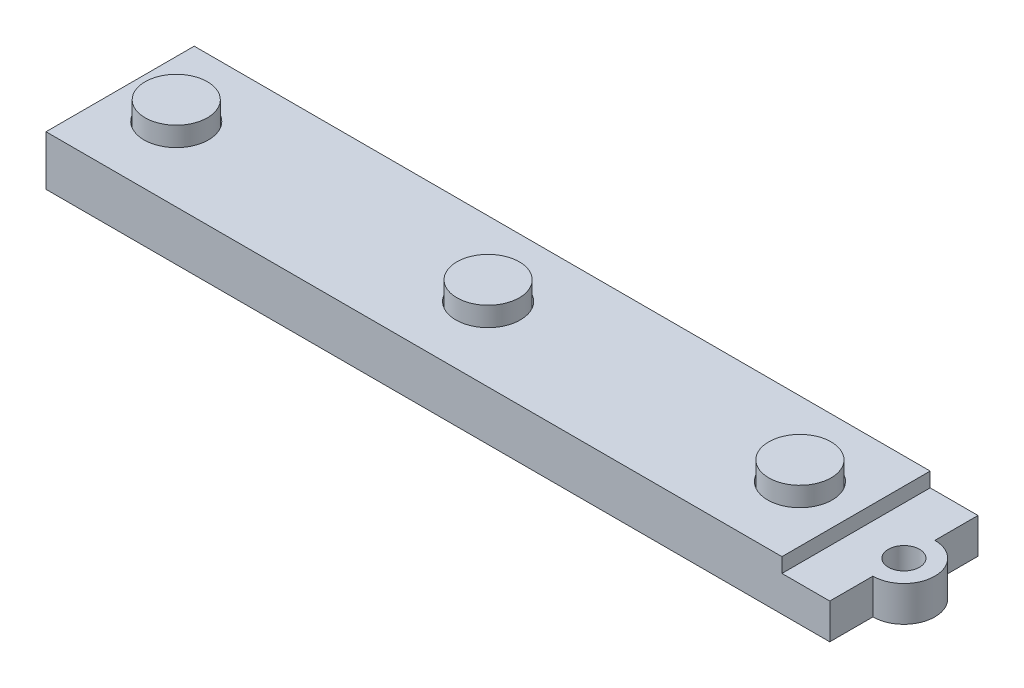
ISO-10303-21;
HEADER;
FILE_DESCRIPTION(('STEP AP214'),'2;1');
FILE_NAME('part.step','',(''),(''),'','','');
FILE_SCHEMA(('AUTOMOTIVE_DESIGN { 1 0 10303 214 1 1 1 1 }'));
ENDSEC;
DATA;
#1=APPLICATION_CONTEXT('core data for automotive mechanical design processes');
#2=APPLICATION_PROTOCOL_DEFINITION('international standard','automotive_design',2000,#1);
#3=PRODUCT_CONTEXT('',#1,'mechanical');
#4=PRODUCT('Part','Part','',(#3));
#5=PRODUCT_RELATED_PRODUCT_CATEGORY('part','',(#4));
#6=PRODUCT_DEFINITION_FORMATION('','',#4);
#7=PRODUCT_DEFINITION_CONTEXT('part definition',#1,'design');
#8=PRODUCT_DEFINITION('design','',#6,#7);
#9=PRODUCT_DEFINITION_SHAPE('','',#8);
#10=(LENGTH_UNIT() NAMED_UNIT(*) SI_UNIT(.MILLI.,.METRE.));
#11=(NAMED_UNIT(*) PLANE_ANGLE_UNIT() SI_UNIT($,.RADIAN.));
#12=(NAMED_UNIT(*) SI_UNIT($,.STERADIAN.) SOLID_ANGLE_UNIT());
#13=UNCERTAINTY_MEASURE_WITH_UNIT(LENGTH_MEASURE(1.E-05),#10,'distance_accuracy_value','');
#14=(GEOMETRIC_REPRESENTATION_CONTEXT(3) GLOBAL_UNCERTAINTY_ASSIGNED_CONTEXT((#13)) GLOBAL_UNIT_ASSIGNED_CONTEXT((#10,
#11,#12)) REPRESENTATION_CONTEXT('',''));
#15=CARTESIAN_POINT('',(0.,0.,0.));
#16=DIRECTION('',(0.,0.,1.));
#17=DIRECTION('',(1.,0.,0.));
#18=AXIS2_PLACEMENT_3D('',#15,#16,#17);
#19=CARTESIAN_POINT('',(0.,0.,0.));
#20=DIRECTION('',(0.,1.,0.));
#21=DIRECTION('',(0.,0.,1.));
#22=AXIS2_PLACEMENT_3D('',#19,#20,#21);
#23=PLANE('',#22);
#24=CARTESIAN_POINT('',(-20.4046666666667,0.,-25.8942737373737));
#25=DIRECTION('',(0.,1.,0.));
#26=DIRECTION('',(0.,0.,1.));
#27=AXIS2_PLACEMENT_3D('',#24,#25,#26);
#28=CIRCLE('',#27,1.905);
#29=CARTESIAN_POINT('',(-20.4046666666667,0.,-23.9892737373737));
#30=VERTEX_POINT('',#29);
#31=EDGE_CURVE('E209',#30,#30,#28,.T.);
#32=ORIENTED_EDGE('',*,*,#31,.T.);
#33=EDGE_LOOP('',(#32));
#34=FACE_BOUND('',#33,.T.);
#35=DIRECTION('',(0.,0.,-1.));
#36=VECTOR('',#35,1.);
#37=CARTESIAN_POINT('',(-112.479666666667,0.,-32.2442737373737));
#38=LINE('',#37,#36);
#39=CARTESIAN_POINT('',(-112.479666666667,0.,-19.5442737373737));
#40=VERTEX_POINT('',#39);
#41=CARTESIAN_POINT('',(-112.479666666667,0.,-32.2442737373737));
#42=VERTEX_POINT('',#41);
#43=EDGE_CURVE('E160',#40,#42,#38,.T.);
#44=ORIENTED_EDGE('',*,*,#43,.F.);
#45=DIRECTION('',(-1.,0.,0.));
#46=VECTOR('',#45,1.);
#47=CARTESIAN_POINT('',(-29.9296666666666,0.,-19.5442737373737));
#48=LINE('',#47,#46);
#49=CARTESIAN_POINT('',(-29.9296666666666,0.,-19.5442737373737));
#50=VERTEX_POINT('',#49);
#51=EDGE_CURVE('E165',#50,#40,#48,.T.);
#52=ORIENTED_EDGE('',*,*,#51,.F.);
#53=DIRECTION('',(0.,0.,1.));
#54=VECTOR('',#53,1.);
#55=CARTESIAN_POINT('',(-29.9296666666666,0.,-32.2442737373737));
#56=LINE('',#55,#54);
#57=CARTESIAN_POINT('',(-29.9296666666666,0.,-32.2442737373737));
#58=VERTEX_POINT('',#57);
#59=EDGE_CURVE('E175',#58,#50,#56,.T.);
#60=ORIENTED_EDGE('',*,*,#59,.F.);
#61=DIRECTION('',(1.,0.,0.));
#62=VECTOR('',#61,1.);
#63=CARTESIAN_POINT('',(-29.9296666666666,0.,-32.2442737373737));
#64=LINE('',#63,#62);
#65=EDGE_CURVE('E58',#42,#58,#64,.T.);
#66=ORIENTED_EDGE('',*,*,#65,.F.);
#67=EDGE_LOOP('',(#44,#52,#60,#66));
#68=FACE_BOUND('',#67,.T.);
#69=DIRECTION('',(-1.,0.,0.));
#70=VECTOR('',#69,1.);
#71=CARTESIAN_POINT('',(-116.162666666667,0.,-34.9493737373737));
#72=LINE('',#71,#70);
#73=CARTESIAN_POINT('',(-20.4046666666667,0.,-34.9493737373737));
#74=VERTEX_POINT('',#73);
#75=CARTESIAN_POINT('',(-116.162666666667,0.,-34.9493737373737));
#76=VERTEX_POINT('',#75);
#77=EDGE_CURVE('E231',#74,#76,#72,.T.);
#78=ORIENTED_EDGE('',*,*,#77,.F.);
#79=DIRECTION('',(0.,0.,1.));
#80=VECTOR('',#79,1.);
#81=CARTESIAN_POINT('',(-20.4046666666667,0.,0.));
#82=LINE('',#81,#80);
#83=CARTESIAN_POINT('',(-20.4046666666667,0.,-29.6800450522713));
#84=VERTEX_POINT('',#83);
#85=EDGE_CURVE('E157',#74,#84,#82,.T.);
#86=ORIENTED_EDGE('',*,*,#85,.T.);
#87=CARTESIAN_POINT('',(-20.4046666666667,0.,-25.8942737373737));
#88=DIRECTION('',(0.,1.,0.));
#89=DIRECTION('',(0.,0.,1.));
#90=AXIS2_PLACEMENT_3D('',#87,#88,#89);
#91=CIRCLE('',#90,3.78577131489756);
#92=CARTESIAN_POINT('',(-20.4046666666667,0.,-22.1085024224762));
#93=VERTEX_POINT('',#92);
#94=EDGE_CURVE('E153',#84,#93,#91,.F.);
#95=ORIENTED_EDGE('',*,*,#94,.T.);
#96=DIRECTION('',(0.,0.,1.));
#97=VECTOR('',#96,1.);
#98=CARTESIAN_POINT('',(-20.4046666666666,0.,0.));
#99=LINE('',#98,#97);
#100=CARTESIAN_POINT('',(-20.4046666666666,0.,-16.8391737373737));
#101=VERTEX_POINT('',#100);
#102=EDGE_CURVE('E131',#93,#101,#99,.T.);
#103=ORIENTED_EDGE('',*,*,#102,.T.);
#104=DIRECTION('',(1.,0.,0.));
#105=VECTOR('',#104,1.);
#106=CARTESIAN_POINT('',(-116.162666666667,0.,-16.8391737373737));
#107=LINE('',#106,#105);
#108=CARTESIAN_POINT('',(-116.162666666667,0.,-16.8391737373737));
#109=VERTEX_POINT('',#108);
#110=EDGE_CURVE('E238',#109,#101,#107,.T.);
#111=ORIENTED_EDGE('',*,*,#110,.F.);
#112=DIRECTION('',(0.,0.,1.));
#113=VECTOR('',#112,1.);
#114=CARTESIAN_POINT('',(-116.162666666667,0.,-34.9493737373737));
#115=LINE('',#114,#113);
#116=EDGE_CURVE('E224',#76,#109,#115,.T.);
#117=ORIENTED_EDGE('',*,*,#116,.F.);
#118=EDGE_LOOP('',(#78,#86,#95,#103,#111,#117));
#119=FACE_BOUND('',#118,.T.);
#120=ADVANCED_FACE('F35',(#34,#68,#119),#23,.F.);
#121=CARTESIAN_POINT('',(0.,4.318,0.));
#122=DIRECTION('',(0.,1.,0.));
#123=DIRECTION('',(0.,0.,1.));
#124=AXIS2_PLACEMENT_3D('',#121,#122,#123);
#125=PLANE('',#124);
#126=CARTESIAN_POINT('',(-20.4046666666667,4.318,-25.8942737373737));
#127=DIRECTION('',(0.,1.,0.));
#128=DIRECTION('',(0.,0.,1.));
#129=AXIS2_PLACEMENT_3D('',#126,#127,#128);
#130=CIRCLE('',#129,1.905);
#131=CARTESIAN_POINT('',(-20.4046666666667,4.318,-23.9892737373737));
#132=VERTEX_POINT('',#131);
#133=EDGE_CURVE('E206',#132,#132,#130,.T.);
#134=ORIENTED_EDGE('',*,*,#133,.F.);
#135=EDGE_LOOP('',(#134));
#136=FACE_BOUND('',#135,.T.);
#137=DIRECTION('',(0.,0.,1.));
#138=VECTOR('',#137,1.);
#139=CARTESIAN_POINT('',(-20.4046666666667,4.318,-34.9493737373737));
#140=LINE('',#139,#138);
#141=CARTESIAN_POINT('',(-20.4046666666667,4.318,-34.9493737373737));
#142=VERTEX_POINT('',#141);
#143=CARTESIAN_POINT('',(-20.4046666666667,4.318,-29.6800450522713));
#144=VERTEX_POINT('',#143);
#145=EDGE_CURVE('E50',#142,#144,#140,.T.);
#146=ORIENTED_EDGE('',*,*,#145,.F.);
#147=DIRECTION('',(-1.,0.,0.));
#148=VECTOR('',#147,1.);
#149=CARTESIAN_POINT('',(-26.2466666666667,4.318,-34.9493737373737));
#150=LINE('',#149,#148);
#151=CARTESIAN_POINT('',(-26.2466666666667,4.318,-34.9493737373737));
#152=VERTEX_POINT('',#151);
#153=EDGE_CURVE('E218',#142,#152,#150,.T.);
#154=ORIENTED_EDGE('',*,*,#153,.T.);
#155=DIRECTION('',(0.,0.,1.));
#156=VECTOR('',#155,1.);
#157=CARTESIAN_POINT('',(-26.2466666666667,4.318,-34.9493737373737));
#158=LINE('',#157,#156);
#159=CARTESIAN_POINT('',(-26.2466666666667,4.318,-16.8391737373737));
#160=VERTEX_POINT('',#159);
#161=EDGE_CURVE('E215',#152,#160,#158,.T.);
#162=ORIENTED_EDGE('',*,*,#161,.T.);
#163=DIRECTION('',(1.,0.,0.));
#164=VECTOR('',#163,1.);
#165=CARTESIAN_POINT('',(-26.2466666666667,4.318,-16.8391737373737));
#166=LINE('',#165,#164);
#167=CARTESIAN_POINT('',(-20.4046666666666,4.318,-16.8391737373737));
#168=VERTEX_POINT('',#167);
#169=EDGE_CURVE('E146',#160,#168,#166,.T.);
#170=ORIENTED_EDGE('',*,*,#169,.T.);
#171=DIRECTION('',(0.,0.,1.));
#172=VECTOR('',#171,1.);
#173=CARTESIAN_POINT('',(-20.4046666666667,4.318,-22.1085024224762));
#174=LINE('',#173,#172);
#175=CARTESIAN_POINT('',(-20.4046666666667,4.318,-22.1085024224762));
#176=VERTEX_POINT('',#175);
#177=EDGE_CURVE('E128',#176,#168,#174,.T.);
#178=ORIENTED_EDGE('',*,*,#177,.F.);
#179=CARTESIAN_POINT('',(-20.4046666666667,4.318,-25.8942737373737));
#180=DIRECTION('',(0.,-1.,0.));
#181=DIRECTION('',(0.,0.,1.));
#182=AXIS2_PLACEMENT_3D('',#179,#180,#181);
#183=CIRCLE('',#182,3.78577131489756);
#184=EDGE_CURVE('E138',#144,#176,#183,.T.);
#185=ORIENTED_EDGE('',*,*,#184,.F.);
#186=EDGE_LOOP('',(#146,#154,#162,#170,#178,#185));
#187=FACE_BOUND('',#186,.T.);
#188=ADVANCED_FACE('F143',(#136,#187),#125,.T.);
#189=CARTESIAN_POINT('',(-116.162666666667,6.096,-34.9493737373737));
#190=DIRECTION('',(1.,0.,0.));
#191=DIRECTION('',(0.,0.,-1.));
#192=AXIS2_PLACEMENT_3D('',#189,#190,#191);
#193=PLANE('',#192);
#194=ORIENTED_EDGE('',*,*,#116,.T.);
#195=DIRECTION('',(0.,-1.,0.));
#196=VECTOR('',#195,1.);
#197=CARTESIAN_POINT('',(-116.162666666667,6.096,-16.8391737373737));
#198=LINE('',#197,#196);
#199=CARTESIAN_POINT('',(-116.162666666667,6.096,-16.8391737373737));
#200=VERTEX_POINT('',#199);
#201=EDGE_CURVE('E11',#200,#109,#198,.T.);
#202=ORIENTED_EDGE('',*,*,#201,.F.);
#203=DIRECTION('',(0.,0.,1.));
#204=VECTOR('',#203,1.);
#205=CARTESIAN_POINT('',(-116.162666666667,6.096,-34.9493737373737));
#206=LINE('',#205,#204);
#207=CARTESIAN_POINT('',(-116.162666666667,6.096,-34.9493737373737));
#208=VERTEX_POINT('',#207);
#209=EDGE_CURVE('E227',#208,#200,#206,.T.);
#210=ORIENTED_EDGE('',*,*,#209,.F.);
#211=DIRECTION('',(0.,-1.,0.));
#212=VECTOR('',#211,1.);
#213=CARTESIAN_POINT('',(-116.162666666667,6.096,-34.9493737373737));
#214=LINE('',#213,#212);
#215=EDGE_CURVE('E43',#208,#76,#214,.T.);
#216=ORIENTED_EDGE('',*,*,#215,.T.);
#217=EDGE_LOOP('',(#194,#202,#210,#216));
#218=FACE_BOUND('',#217,.T.);
#219=ADVANCED_FACE('F37',(#218),#193,.F.);
#220=CARTESIAN_POINT('',(-116.162666666667,6.096,-16.8391737373737));
#221=DIRECTION('',(0.,0.,-1.));
#222=DIRECTION('',(-1.,0.,0.));
#223=AXIS2_PLACEMENT_3D('',#220,#221,#222);
#224=PLANE('',#223);
#225=ORIENTED_EDGE('',*,*,#110,.T.);
#226=DIRECTION('',(0.,1.,0.));
#227=VECTOR('',#226,1.);
#228=CARTESIAN_POINT('',(-20.4046666666666,-1.27,-16.8391737373737));
#229=LINE('',#228,#227);
#230=EDGE_CURVE('E134',#101,#168,#229,.T.);
#231=ORIENTED_EDGE('',*,*,#230,.T.);
#232=ORIENTED_EDGE('',*,*,#169,.F.);
#233=DIRECTION('',(0.,1.,0.));
#234=VECTOR('',#233,1.);
#235=CARTESIAN_POINT('',(-26.2466666666667,4.318,-16.8391737373737));
#236=LINE('',#235,#234);
#237=CARTESIAN_POINT('',(-26.2466666666667,6.096,-16.8391737373737));
#238=VERTEX_POINT('',#237);
#239=EDGE_CURVE('E220',#160,#238,#236,.T.);
#240=ORIENTED_EDGE('',*,*,#239,.T.);
#241=DIRECTION('',(1.,0.,0.));
#242=VECTOR('',#241,1.);
#243=CARTESIAN_POINT('',(-116.162666666667,6.096,-16.8391737373737));
#244=LINE('',#243,#242);
#245=EDGE_CURVE('E230',#200,#238,#244,.T.);
#246=ORIENTED_EDGE('',*,*,#245,.F.);
#247=ORIENTED_EDGE('',*,*,#201,.T.);
#248=EDGE_LOOP('',(#225,#231,#232,#240,#246,#247));
#249=FACE_BOUND('',#248,.T.);
#250=ADVANCED_FACE('F252',(#249),#224,.F.);
#251=CARTESIAN_POINT('',(-116.162666666667,6.096,-34.9493737373737));
#252=DIRECTION('',(0.,0.,1.));
#253=DIRECTION('',(1.,0.,0.));
#254=AXIS2_PLACEMENT_3D('',#251,#252,#253);
#255=PLANE('',#254);
#256=ORIENTED_EDGE('',*,*,#153,.F.);
#257=DIRECTION('',(0.,1.,0.));
#258=VECTOR('',#257,1.);
#259=CARTESIAN_POINT('',(-20.4046666666667,-1.27,-34.9493737373737));
#260=LINE('',#259,#258);
#261=EDGE_CURVE('E151',#74,#142,#260,.T.);
#262=ORIENTED_EDGE('',*,*,#261,.F.);
#263=ORIENTED_EDGE('',*,*,#77,.T.);
#264=ORIENTED_EDGE('',*,*,#215,.F.);
#265=DIRECTION('',(-1.,0.,0.));
#266=VECTOR('',#265,1.);
#267=CARTESIAN_POINT('',(-116.162666666667,6.096,-34.9493737373737));
#268=LINE('',#267,#266);
#269=CARTESIAN_POINT('',(-26.2466666666667,6.096,-34.9493737373737));
#270=VERTEX_POINT('',#269);
#271=EDGE_CURVE('E234',#270,#208,#268,.T.);
#272=ORIENTED_EDGE('',*,*,#271,.F.);
#273=DIRECTION('',(0.,1.,0.));
#274=VECTOR('',#273,1.);
#275=CARTESIAN_POINT('',(-26.2466666666667,4.318,-34.9493737373737));
#276=LINE('',#275,#274);
#277=EDGE_CURVE('E222',#152,#270,#276,.T.);
#278=ORIENTED_EDGE('',*,*,#277,.F.);
#279=EDGE_LOOP('',(#256,#262,#263,#264,#272,#278));
#280=FACE_BOUND('',#279,.T.);
#281=ADVANCED_FACE('F258',(#280),#255,.F.);
#282=CARTESIAN_POINT('',(0.,6.096,0.));
#283=DIRECTION('',(0.,1.,0.));
#284=DIRECTION('',(0.,0.,1.));
#285=AXIS2_PLACEMENT_3D('',#282,#283,#284);
#286=PLANE('',#285);
#287=CARTESIAN_POINT('',(-71.2046666666667,6.096,-25.8942737373734));
#288=DIRECTION('',(0.,1.,0.));
#289=DIRECTION('',(0.,0.,1.));
#290=AXIS2_PLACEMENT_3D('',#287,#288,#289);
#291=CIRCLE('',#290,3.937);
#292=CARTESIAN_POINT('',(-71.2046666666667,6.096,-21.9572737373734));
#293=VERTEX_POINT('',#292);
#294=EDGE_CURVE('E195',#293,#293,#291,.T.);
#295=ORIENTED_EDGE('',*,*,#294,.F.);
#296=EDGE_LOOP('',(#295));
#297=FACE_BOUND('',#296,.T.);
#298=CARTESIAN_POINT('',(-109.304666666667,6.096,-25.8942737373732));
#299=DIRECTION('',(0.,1.,0.));
#300=DIRECTION('',(0.,0.,1.));
#301=AXIS2_PLACEMENT_3D('',#298,#299,#300);
#302=CIRCLE('',#301,3.937);
#303=CARTESIAN_POINT('',(-109.304666666667,6.096,-21.9572737373732));
#304=VERTEX_POINT('',#303);
#305=EDGE_CURVE('E190',#304,#304,#302,.T.);
#306=ORIENTED_EDGE('',*,*,#305,.F.);
#307=EDGE_LOOP('',(#306));
#308=FACE_BOUND('',#307,.T.);
#309=CARTESIAN_POINT('',(-33.1046666666667,6.096,-25.8942737373737));
#310=DIRECTION('',(0.,1.,0.));
#311=DIRECTION('',(0.,0.,1.));
#312=AXIS2_PLACEMENT_3D('',#309,#310,#311);
#313=CIRCLE('',#312,3.937);
#314=CARTESIAN_POINT('',(-33.1046666666667,6.096,-21.9572737373737));
#315=VERTEX_POINT('',#314);
#316=EDGE_CURVE('E194',#315,#315,#313,.T.);
#317=ORIENTED_EDGE('',*,*,#316,.F.);
#318=EDGE_LOOP('',(#317));
#319=FACE_BOUND('',#318,.T.);
#320=DIRECTION('',(0.,0.,1.));
#321=VECTOR('',#320,1.);
#322=CARTESIAN_POINT('',(-26.2466666666667,6.096,-34.9493737373737));
#323=LINE('',#322,#321);
#324=EDGE_CURVE('E212',#270,#238,#323,.T.);
#325=ORIENTED_EDGE('',*,*,#324,.F.);
#326=ORIENTED_EDGE('',*,*,#271,.T.);
#327=ORIENTED_EDGE('',*,*,#209,.T.);
#328=ORIENTED_EDGE('',*,*,#245,.T.);
#329=EDGE_LOOP('',(#325,#326,#327,#328));
#330=FACE_BOUND('',#329,.T.);
#331=ADVANCED_FACE('F255',(#297,#308,#319,#330),#286,.T.);
#332=CARTESIAN_POINT('',(-26.2466666666667,4.318,-34.9493737373737));
#333=DIRECTION('',(-1.,0.,0.));
#334=DIRECTION('',(0.,0.,1.));
#335=AXIS2_PLACEMENT_3D('',#332,#333,#334);
#336=PLANE('',#335);
#337=ORIENTED_EDGE('',*,*,#324,.T.);
#338=ORIENTED_EDGE('',*,*,#239,.F.);
#339=ORIENTED_EDGE('',*,*,#161,.F.);
#340=ORIENTED_EDGE('',*,*,#277,.T.);
#341=EDGE_LOOP('',(#337,#338,#339,#340));
#342=FACE_BOUND('',#341,.T.);
#343=ADVANCED_FACE('F262',(#342),#336,.F.);
#344=CARTESIAN_POINT('',(-20.4046666666667,0.,-25.8942737373737));
#345=DIRECTION('',(0.,1.,0.));
#346=DIRECTION('',(0.,0.,1.));
#347=AXIS2_PLACEMENT_3D('',#344,#345,#346);
#348=CYLINDRICAL_SURFACE('',#347,1.905);
#349=ORIENTED_EDGE('',*,*,#31,.F.);
#350=EDGE_LOOP('',(#349));
#351=FACE_BOUND('',#350,.T.);
#352=ORIENTED_EDGE('',*,*,#133,.T.);
#353=EDGE_LOOP('',(#352));
#354=FACE_BOUND('',#353,.T.);
#355=ADVANCED_FACE('F314',(#351,#354),#348,.F.);
#356=CARTESIAN_POINT('',(-33.1046666666667,4.826,-25.8942737373737));
#357=DIRECTION('',(0.,1.,0.));
#358=DIRECTION('',(0.,0.,1.));
#359=AXIS2_PLACEMENT_3D('',#356,#357,#358);
#360=CYLINDRICAL_SURFACE('',#359,3.937);
#361=CARTESIAN_POINT('',(-33.1046666666667,4.826,-25.8942737373737));
#362=DIRECTION('',(0.,1.,0.));
#363=DIRECTION('',(0.,0.,1.));
#364=AXIS2_PLACEMENT_3D('',#361,#362,#363);
#365=CIRCLE('',#364,3.937);
#366=CARTESIAN_POINT('',(-33.1046666666667,4.826,-21.9572737373737));
#367=VERTEX_POINT('',#366);
#368=EDGE_CURVE('E203',#367,#367,#365,.T.);
#369=ORIENTED_EDGE('',*,*,#368,.F.);
#370=EDGE_LOOP('',(#369));
#371=FACE_BOUND('',#370,.T.);
#372=ORIENTED_EDGE('',*,*,#316,.T.);
#373=EDGE_LOOP('',(#372));
#374=FACE_BOUND('',#373,.T.);
#375=ADVANCED_FACE('F312',(#371,#374),#360,.F.);
#376=CARTESIAN_POINT('',(-33.1046666666667,4.826,-25.8942737373737));
#377=DIRECTION('',(0.,1.,0.));
#378=DIRECTION('',(0.,0.,1.));
#379=AXIS2_PLACEMENT_3D('',#376,#377,#378);
#380=PLANE('',#379);
#381=CARTESIAN_POINT('',(-33.1046666666667,4.826,-25.8942737373737));
#382=DIRECTION('',(0.,1.,0.));
#383=DIRECTION('',(0.,0.,1.));
#384=AXIS2_PLACEMENT_3D('',#381,#382,#383);
#385=CIRCLE('',#384,3.81);
#386=CARTESIAN_POINT('',(-33.1046666666667,4.826,-22.0842737373737));
#387=VERTEX_POINT('',#386);
#388=EDGE_CURVE('E265',#387,#387,#385,.T.);
#389=ORIENTED_EDGE('',*,*,#388,.F.);
#390=EDGE_LOOP('',(#389));
#391=FACE_BOUND('',#390,.T.);
#392=ORIENTED_EDGE('',*,*,#368,.T.);
#393=EDGE_LOOP('',(#392));
#394=FACE_BOUND('',#393,.T.);
#395=ADVANCED_FACE('F302',(#391,#394),#380,.T.);
#396=CARTESIAN_POINT('',(-109.304666666667,4.826,-25.8942737373732));
#397=DIRECTION('',(0.,1.,0.));
#398=DIRECTION('',(0.,0.,1.));
#399=AXIS2_PLACEMENT_3D('',#396,#397,#398);
#400=CYLINDRICAL_SURFACE('',#399,3.937);
#401=CARTESIAN_POINT('',(-109.304666666667,4.826,-25.8942737373732));
#402=DIRECTION('',(0.,1.,0.));
#403=DIRECTION('',(0.,0.,1.));
#404=AXIS2_PLACEMENT_3D('',#401,#402,#403);
#405=CIRCLE('',#404,3.937);
#406=CARTESIAN_POINT('',(-109.304666666667,4.826,-21.9572737373732));
#407=VERTEX_POINT('',#406);
#408=EDGE_CURVE('E198',#407,#407,#405,.T.);
#409=ORIENTED_EDGE('',*,*,#408,.F.);
#410=EDGE_LOOP('',(#409));
#411=FACE_BOUND('',#410,.T.);
#412=ORIENTED_EDGE('',*,*,#305,.T.);
#413=EDGE_LOOP('',(#412));
#414=FACE_BOUND('',#413,.T.);
#415=ADVANCED_FACE('F296',(#411,#414),#400,.F.);
#416=CARTESIAN_POINT('',(-109.304666666667,4.826,-25.8942737373732));
#417=DIRECTION('',(0.,1.,0.));
#418=DIRECTION('',(0.,0.,1.));
#419=AXIS2_PLACEMENT_3D('',#416,#417,#418);
#420=PLANE('',#419);
#421=CARTESIAN_POINT('',(-109.304666666667,4.826,-25.8942737373732));
#422=DIRECTION('',(0.,1.,0.));
#423=DIRECTION('',(0.,0.,1.));
#424=AXIS2_PLACEMENT_3D('',#421,#422,#423);
#425=CIRCLE('',#424,3.81);
#426=CARTESIAN_POINT('',(-109.304666666667,4.826,-22.0842737373732));
#427=VERTEX_POINT('',#426);
#428=EDGE_CURVE('E277',#427,#427,#425,.T.);
#429=ORIENTED_EDGE('',*,*,#428,.F.);
#430=EDGE_LOOP('',(#429));
#431=FACE_BOUND('',#430,.T.);
#432=ORIENTED_EDGE('',*,*,#408,.T.);
#433=EDGE_LOOP('',(#432));
#434=FACE_BOUND('',#433,.T.);
#435=ADVANCED_FACE('F292',(#431,#434),#420,.T.);
#436=CARTESIAN_POINT('',(-71.2046666666667,4.826,-25.8942737373734));
#437=DIRECTION('',(0.,1.,0.));
#438=DIRECTION('',(0.,0.,1.));
#439=AXIS2_PLACEMENT_3D('',#436,#437,#438);
#440=CYLINDRICAL_SURFACE('',#439,3.937);
#441=CARTESIAN_POINT('',(-71.2046666666667,4.826,-25.8942737373734));
#442=DIRECTION('',(0.,1.,0.));
#443=DIRECTION('',(0.,0.,1.));
#444=AXIS2_PLACEMENT_3D('',#441,#442,#443);
#445=CIRCLE('',#444,3.937);
#446=CARTESIAN_POINT('',(-71.2046666666667,4.826,-21.9572737373734));
#447=VERTEX_POINT('',#446);
#448=EDGE_CURVE('E191',#447,#447,#445,.T.);
#449=ORIENTED_EDGE('',*,*,#448,.F.);
#450=EDGE_LOOP('',(#449));
#451=FACE_BOUND('',#450,.T.);
#452=ORIENTED_EDGE('',*,*,#294,.T.);
#453=EDGE_LOOP('',(#452));
#454=FACE_BOUND('',#453,.T.);
#455=ADVANCED_FACE('F295',(#451,#454),#440,.F.);
#456=CARTESIAN_POINT('',(-71.2046666666667,4.826,-25.8942737373734));
#457=DIRECTION('',(0.,1.,0.));
#458=DIRECTION('',(0.,0.,1.));
#459=AXIS2_PLACEMENT_3D('',#456,#457,#458);
#460=PLANE('',#459);
#461=CARTESIAN_POINT('',(-71.2046666666667,4.826,-25.8942737373734));
#462=DIRECTION('',(0.,1.,0.));
#463=DIRECTION('',(0.,0.,1.));
#464=AXIS2_PLACEMENT_3D('',#461,#462,#463);
#465=CIRCLE('',#464,3.81000000000001);
#466=CARTESIAN_POINT('',(-71.2046666666667,4.826,-22.0842737373734));
#467=VERTEX_POINT('',#466);
#468=EDGE_CURVE('E271',#467,#467,#465,.T.);
#469=ORIENTED_EDGE('',*,*,#468,.F.);
#470=EDGE_LOOP('',(#469));
#471=FACE_BOUND('',#470,.T.);
#472=ORIENTED_EDGE('',*,*,#448,.T.);
#473=EDGE_LOOP('',(#472));
#474=FACE_BOUND('',#473,.T.);
#475=ADVANCED_FACE('F414',(#471,#474),#460,.T.);
#476=CARTESIAN_POINT('',(-112.479666666667,-1.27,-32.2442737373737));
#477=DIRECTION('',(1.,0.,0.));
#478=DIRECTION('',(0.,0.,-1.));
#479=AXIS2_PLACEMENT_3D('',#476,#477,#478);
#480=PLANE('',#479);
#481=ORIENTED_EDGE('',*,*,#43,.T.);
#482=DIRECTION('',(0.,1.,0.));
#483=VECTOR('',#482,1.);
#484=CARTESIAN_POINT('',(-112.479666666667,-1.27,-32.2442737373737));
#485=LINE('',#484,#483);
#486=CARTESIAN_POINT('',(-112.479666666667,-1.27,-32.2442737373737));
#487=VERTEX_POINT('',#486);
#488=EDGE_CURVE('E188',#487,#42,#485,.T.);
#489=ORIENTED_EDGE('',*,*,#488,.F.);
#490=DIRECTION('',(0.,0.,-1.));
#491=VECTOR('',#490,1.);
#492=CARTESIAN_POINT('',(-112.479666666667,-1.27,-32.2442737373737));
#493=LINE('',#492,#491);
#494=CARTESIAN_POINT('',(-112.479666666667,-1.27,-19.5442737373737));
#495=VERTEX_POINT('',#494);
#496=EDGE_CURVE('E161',#495,#487,#493,.T.);
#497=ORIENTED_EDGE('',*,*,#496,.F.);
#498=DIRECTION('',(0.,1.,0.));
#499=VECTOR('',#498,1.);
#500=CARTESIAN_POINT('',(-112.479666666667,-1.27,-19.5442737373737));
#501=LINE('',#500,#499);
#502=EDGE_CURVE('E171',#495,#40,#501,.T.);
#503=ORIENTED_EDGE('',*,*,#502,.T.);
#504=EDGE_LOOP('',(#481,#489,#497,#503));
#505=FACE_BOUND('',#504,.T.);
#506=ADVANCED_FACE('F419',(#505),#480,.F.);
#507=CARTESIAN_POINT('',(-29.9296666666666,-1.27,-32.2442737373737));
#508=DIRECTION('',(0.,0.,1.));
#509=DIRECTION('',(1.,0.,0.));
#510=AXIS2_PLACEMENT_3D('',#507,#508,#509);
#511=PLANE('',#510);
#512=ORIENTED_EDGE('',*,*,#65,.T.);
#513=DIRECTION('',(0.,1.,0.));
#514=VECTOR('',#513,1.);
#515=CARTESIAN_POINT('',(-29.9296666666666,-1.27,-32.2442737373737));
#516=LINE('',#515,#514);
#517=CARTESIAN_POINT('',(-29.9296666666666,-1.27,-32.2442737373737));
#518=VERTEX_POINT('',#517);
#519=EDGE_CURVE('E185',#518,#58,#516,.T.);
#520=ORIENTED_EDGE('',*,*,#519,.F.);
#521=DIRECTION('',(1.,0.,0.));
#522=VECTOR('',#521,1.);
#523=CARTESIAN_POINT('',(-29.9296666666666,-1.27,-32.2442737373737));
#524=LINE('',#523,#522);
#525=EDGE_CURVE('E164',#487,#518,#524,.T.);
#526=ORIENTED_EDGE('',*,*,#525,.F.);
#527=ORIENTED_EDGE('',*,*,#488,.T.);
#528=EDGE_LOOP('',(#512,#520,#526,#527));
#529=FACE_BOUND('',#528,.T.);
#530=ADVANCED_FACE('F486',(#529),#511,.F.);
#531=CARTESIAN_POINT('',(-29.9296666666666,-1.27,-32.2442737373737));
#532=DIRECTION('',(-1.,0.,0.));
#533=DIRECTION('',(0.,0.,1.));
#534=AXIS2_PLACEMENT_3D('',#531,#532,#533);
#535=PLANE('',#534);
#536=ORIENTED_EDGE('',*,*,#59,.T.);
#537=DIRECTION('',(0.,1.,0.));
#538=VECTOR('',#537,1.);
#539=CARTESIAN_POINT('',(-29.9296666666666,-1.27,-19.5442737373737));
#540=LINE('',#539,#538);
#541=CARTESIAN_POINT('',(-29.9296666666666,-1.27,-19.5442737373737));
#542=VERTEX_POINT('',#541);
#543=EDGE_CURVE('E182',#542,#50,#540,.T.);
#544=ORIENTED_EDGE('',*,*,#543,.F.);
#545=DIRECTION('',(0.,0.,1.));
#546=VECTOR('',#545,1.);
#547=CARTESIAN_POINT('',(-29.9296666666666,-1.27,-32.2442737373737));
#548=LINE('',#547,#546);
#549=EDGE_CURVE('E167',#518,#542,#548,.T.);
#550=ORIENTED_EDGE('',*,*,#549,.F.);
#551=ORIENTED_EDGE('',*,*,#519,.T.);
#552=EDGE_LOOP('',(#536,#544,#550,#551));
#553=FACE_BOUND('',#552,.T.);
#554=ADVANCED_FACE('F482',(#553),#535,.F.);
#555=CARTESIAN_POINT('',(-29.9296666666666,-1.27,-19.5442737373737));
#556=DIRECTION('',(0.,0.,-1.));
#557=DIRECTION('',(-1.,0.,0.));
#558=AXIS2_PLACEMENT_3D('',#555,#556,#557);
#559=PLANE('',#558);
#560=ORIENTED_EDGE('',*,*,#51,.T.);
#561=ORIENTED_EDGE('',*,*,#502,.F.);
#562=DIRECTION('',(-1.,0.,0.));
#563=VECTOR('',#562,1.);
#564=CARTESIAN_POINT('',(-29.9296666666666,-1.27,-19.5442737373737));
#565=LINE('',#564,#563);
#566=EDGE_CURVE('E169',#542,#495,#565,.T.);
#567=ORIENTED_EDGE('',*,*,#566,.F.);
#568=ORIENTED_EDGE('',*,*,#543,.T.);
#569=EDGE_LOOP('',(#560,#561,#567,#568));
#570=FACE_BOUND('',#569,.T.);
#571=ADVANCED_FACE('F478',(#570),#559,.F.);
#572=CARTESIAN_POINT('',(0.,-1.27,0.));
#573=DIRECTION('',(0.,-1.,0.));
#574=DIRECTION('',(0.,0.,-1.));
#575=AXIS2_PLACEMENT_3D('',#572,#573,#574);
#576=PLANE('',#575);
#577=ORIENTED_EDGE('',*,*,#496,.T.);
#578=ORIENTED_EDGE('',*,*,#525,.T.);
#579=ORIENTED_EDGE('',*,*,#549,.T.);
#580=ORIENTED_EDGE('',*,*,#566,.T.);
#581=EDGE_LOOP('',(#577,#578,#579,#580));
#582=FACE_BOUND('',#581,.T.);
#583=ADVANCED_FACE('F373',(#582),#576,.T.);
#584=CARTESIAN_POINT('',(-20.4046666666667,-1.27,-34.9493737373737));
#585=DIRECTION('',(-1.,0.,0.));
#586=DIRECTION('',(0.,0.,1.));
#587=AXIS2_PLACEMENT_3D('',#584,#585,#586);
#588=PLANE('',#587);
#589=ORIENTED_EDGE('',*,*,#261,.T.);
#590=ORIENTED_EDGE('',*,*,#145,.T.);
#591=DIRECTION('',(0.,1.,0.));
#592=VECTOR('',#591,1.);
#593=CARTESIAN_POINT('',(-20.4046666666667,-1.27,-29.6800450522713));
#594=LINE('',#593,#592);
#595=EDGE_CURVE('E135',#84,#144,#594,.T.);
#596=ORIENTED_EDGE('',*,*,#595,.F.);
#597=ORIENTED_EDGE('',*,*,#85,.F.);
#598=EDGE_LOOP('',(#589,#590,#596,#597));
#599=FACE_BOUND('',#598,.T.);
#600=ADVANCED_FACE('F368',(#599),#588,.F.);
#601=CARTESIAN_POINT('',(-20.4046666666667,-1.27,-22.1085024224762));
#602=DIRECTION('',(-1.,0.,0.));
#603=DIRECTION('',(0.,0.,1.));
#604=AXIS2_PLACEMENT_3D('',#601,#602,#603);
#605=PLANE('',#604);
#606=DIRECTION('',(0.,1.,0.));
#607=VECTOR('',#606,1.);
#608=CARTESIAN_POINT('',(-20.4046666666667,-1.27,-22.1085024224762));
#609=LINE('',#608,#607);
#610=EDGE_CURVE('E124',#93,#176,#609,.T.);
#611=ORIENTED_EDGE('',*,*,#610,.T.);
#612=ORIENTED_EDGE('',*,*,#177,.T.);
#613=ORIENTED_EDGE('',*,*,#230,.F.);
#614=ORIENTED_EDGE('',*,*,#102,.F.);
#615=EDGE_LOOP('',(#611,#612,#613,#614));
#616=FACE_BOUND('',#615,.T.);
#617=ADVANCED_FACE('F126',(#616),#605,.F.);
#618=CARTESIAN_POINT('',(-20.4046666666667,-1.27,-25.8942737373737));
#619=DIRECTION('',(0.,1.,0.));
#620=DIRECTION('',(0.,0.,1.));
#621=AXIS2_PLACEMENT_3D('',#618,#619,#620);
#622=CYLINDRICAL_SURFACE('',#621,3.78577131489756);
#623=ORIENTED_EDGE('',*,*,#595,.T.);
#624=ORIENTED_EDGE('',*,*,#184,.T.);
#625=ORIENTED_EDGE('',*,*,#610,.F.);
#626=ORIENTED_EDGE('',*,*,#94,.F.);
#627=EDGE_LOOP('',(#623,#624,#625,#626));
#628=FACE_BOUND('',#627,.T.);
#629=ADVANCED_FACE('F139',(#628),#622,.T.);
#630=CARTESIAN_POINT('',(-33.1046666666667,8.382,-25.8942737373737));
#631=DIRECTION('',(0.,-1.,0.));
#632=DIRECTION('',(0.,0.,-1.));
#633=AXIS2_PLACEMENT_3D('',#630,#631,#632);
#634=CYLINDRICAL_SURFACE('',#633,3.81);
#635=CARTESIAN_POINT('',(-33.1046666666667,8.382,-25.8942737373737));
#636=DIRECTION('',(0.,1.,0.));
#637=DIRECTION('',(0.,0.,1.));
#638=AXIS2_PLACEMENT_3D('',#635,#636,#637);
#639=CIRCLE('',#638,3.81);
#640=CARTESIAN_POINT('',(-33.1046666666667,8.382,-22.0842737373737));
#641=VERTEX_POINT('',#640);
#642=EDGE_CURVE('E263',#641,#641,#639,.T.);
#643=ORIENTED_EDGE('',*,*,#642,.F.);
#644=EDGE_LOOP('',(#643));
#645=FACE_BOUND('',#644,.T.);
#646=ORIENTED_EDGE('',*,*,#388,.T.);
#647=EDGE_LOOP('',(#646));
#648=FACE_BOUND('',#647,.T.);
#649=ADVANCED_FACE('F391',(#645,#648),#634,.T.);
#650=CARTESIAN_POINT('',(-33.1046666666667,8.382,-25.8942737373737));
#651=DIRECTION('',(0.,1.,0.));
#652=DIRECTION('',(0.,0.,1.));
#653=AXIS2_PLACEMENT_3D('',#650,#651,#652);
#654=PLANE('',#653);
#655=ORIENTED_EDGE('',*,*,#642,.T.);
#656=EDGE_LOOP('',(#655));
#657=FACE_BOUND('',#656,.T.);
#658=ADVANCED_FACE('F429',(#657),#654,.T.);
#659=CARTESIAN_POINT('',(-71.2046666666667,8.382,-25.8942737373734));
#660=DIRECTION('',(0.,-1.,0.));
#661=DIRECTION('',(0.,0.,-1.));
#662=AXIS2_PLACEMENT_3D('',#659,#660,#661);
#663=CYLINDRICAL_SURFACE('',#662,3.81000000000001);
#664=CARTESIAN_POINT('',(-71.2046666666667,8.382,-25.8942737373734));
#665=DIRECTION('',(0.,1.,0.));
#666=DIRECTION('',(0.,0.,1.));
#667=AXIS2_PLACEMENT_3D('',#664,#665,#666);
#668=CIRCLE('',#667,3.81000000000001);
#669=CARTESIAN_POINT('',(-71.2046666666667,8.382,-22.0842737373734));
#670=VERTEX_POINT('',#669);
#671=EDGE_CURVE('E269',#670,#670,#668,.T.);
#672=ORIENTED_EDGE('',*,*,#671,.F.);
#673=EDGE_LOOP('',(#672));
#674=FACE_BOUND('',#673,.T.);
#675=ORIENTED_EDGE('',*,*,#468,.T.);
#676=EDGE_LOOP('',(#675));
#677=FACE_BOUND('',#676,.T.);
#678=ADVANCED_FACE('F439',(#674,#677),#663,.T.);
#679=CARTESIAN_POINT('',(-71.2046666666667,8.382,-25.8942737373734));
#680=DIRECTION('',(0.,1.,0.));
#681=DIRECTION('',(0.,0.,1.));
#682=AXIS2_PLACEMENT_3D('',#679,#680,#681);
#683=PLANE('',#682);
#684=ORIENTED_EDGE('',*,*,#671,.T.);
#685=EDGE_LOOP('',(#684));
#686=FACE_BOUND('',#685,.T.);
#687=ADVANCED_FACE('F288',(#686),#683,.T.);
#688=CARTESIAN_POINT('',(-109.304666666667,8.382,-25.8942737373732));
#689=DIRECTION('',(0.,-1.,0.));
#690=DIRECTION('',(0.,0.,-1.));
#691=AXIS2_PLACEMENT_3D('',#688,#689,#690);
#692=CYLINDRICAL_SURFACE('',#691,3.81);
#693=CARTESIAN_POINT('',(-109.304666666667,8.382,-25.8942737373732));
#694=DIRECTION('',(0.,1.,0.));
#695=DIRECTION('',(0.,0.,1.));
#696=AXIS2_PLACEMENT_3D('',#693,#694,#695);
#697=CIRCLE('',#696,3.81);
#698=CARTESIAN_POINT('',(-109.304666666667,8.382,-22.0842737373732));
#699=VERTEX_POINT('',#698);
#700=EDGE_CURVE('E274',#699,#699,#697,.T.);
#701=ORIENTED_EDGE('',*,*,#700,.F.);
#702=EDGE_LOOP('',(#701));
#703=FACE_BOUND('',#702,.T.);
#704=ORIENTED_EDGE('',*,*,#428,.T.);
#705=EDGE_LOOP('',(#704));
#706=FACE_BOUND('',#705,.T.);
#707=ADVANCED_FACE('F285',(#703,#706),#692,.T.);
#708=CARTESIAN_POINT('',(-109.304666666667,8.382,-25.8942737373732));
#709=DIRECTION('',(0.,1.,0.));
#710=DIRECTION('',(0.,0.,1.));
#711=AXIS2_PLACEMENT_3D('',#708,#709,#710);
#712=PLANE('',#711);
#713=ORIENTED_EDGE('',*,*,#700,.T.);
#714=EDGE_LOOP('',(#713));
#715=FACE_BOUND('',#714,.T.);
#716=ADVANCED_FACE('F283',(#715),#712,.T.);
#717=CLOSED_SHELL('',(#120,#188,#219,#250,#281,#331,#343,#355,#375,#395,#415,#435,#455,#475,
#506,#530,#554,#571,#583,#600,#617,#629,#649,#658,#678,#687,#707,#716));
#718=MANIFOLD_SOLID_BREP('B2',#717);
#719=ADVANCED_BREP_SHAPE_REPRESENTATION('',(#18,#718),#14);
#720=SHAPE_DEFINITION_REPRESENTATION(#9,#719);
ENDSEC;
END-ISO-10303-21;
